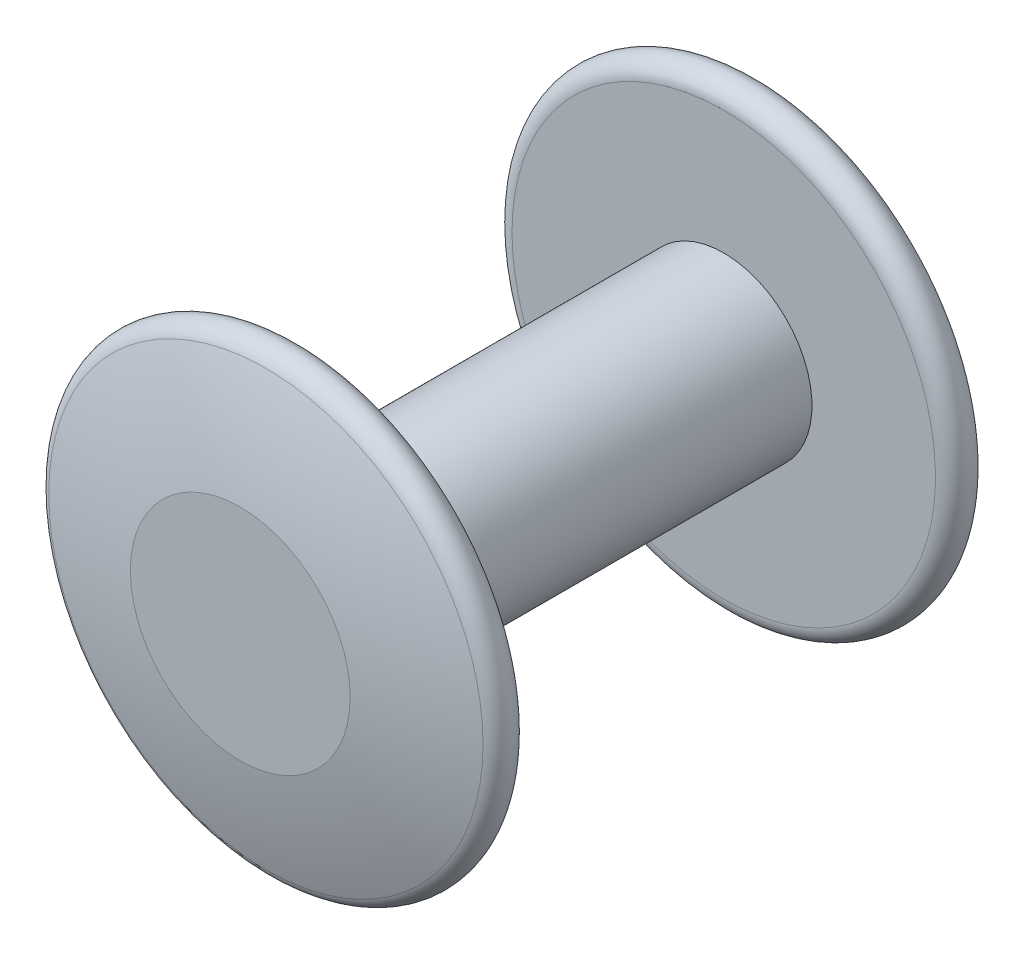
ISO-10303-21;
HEADER;
FILE_DESCRIPTION(('STEP AP214'),'2;1');
FILE_NAME('part.step','',(''),(''),'','','');
FILE_SCHEMA(('AUTOMOTIVE_DESIGN { 1 0 10303 214 1 1 1 1 }'));
ENDSEC;
DATA;
#1=APPLICATION_CONTEXT('core data for automotive mechanical design processes');
#2=APPLICATION_PROTOCOL_DEFINITION('international standard','automotive_design',2000,#1);
#3=PRODUCT_CONTEXT('',#1,'mechanical');
#4=PRODUCT('Part','Part','',(#3));
#5=PRODUCT_RELATED_PRODUCT_CATEGORY('part','',(#4));
#6=PRODUCT_DEFINITION_FORMATION('','',#4);
#7=PRODUCT_DEFINITION_CONTEXT('part definition',#1,'design');
#8=PRODUCT_DEFINITION('design','',#6,#7);
#9=PRODUCT_DEFINITION_SHAPE('','',#8);
#10=(LENGTH_UNIT() NAMED_UNIT(*) SI_UNIT(.MILLI.,.METRE.));
#11=(NAMED_UNIT(*) PLANE_ANGLE_UNIT() SI_UNIT($,.RADIAN.));
#12=(NAMED_UNIT(*) SI_UNIT($,.STERADIAN.) SOLID_ANGLE_UNIT());
#13=UNCERTAINTY_MEASURE_WITH_UNIT(LENGTH_MEASURE(1.E-05),#10,'distance_accuracy_value','');
#14=(GEOMETRIC_REPRESENTATION_CONTEXT(3) GLOBAL_UNCERTAINTY_ASSIGNED_CONTEXT((#13)) GLOBAL_UNIT_ASSIGNED_CONTEXT((#10,
#11,#12)) REPRESENTATION_CONTEXT('',''));
#15=CARTESIAN_POINT('',(0.,0.,0.));
#16=DIRECTION('',(0.,0.,1.));
#17=DIRECTION('',(1.,0.,0.));
#18=AXIS2_PLACEMENT_3D('',#15,#16,#17);
#19=CARTESIAN_POINT('',(0.,0.,6.5));
#20=DIRECTION('',(0.,0.,-1.));
#21=DIRECTION('',(-1.,0.,0.));
#22=AXIS2_PLACEMENT_3D('',#19,#20,#21);
#23=TOROIDAL_SURFACE('',#22,6.,0.5);
#24=CARTESIAN_POINT('',(0.,0.,6.));
#25=DIRECTION('',(0.,0.,-1.));
#26=DIRECTION('',(-1.,0.,0.));
#27=AXIS2_PLACEMENT_3D('',#24,#25,#26);
#28=CIRCLE('',#27,6.);
#29=CARTESIAN_POINT('',(-6.,0.,6.));
#30=VERTEX_POINT('',#29);
#31=EDGE_CURVE('E42',#30,#30,#28,.T.);
#32=ORIENTED_EDGE('',*,*,#31,.F.);
#33=EDGE_LOOP('',(#32));
#34=FACE_BOUND('',#33,.T.);
#35=CARTESIAN_POINT('',(0.,0.,6.97574295680204));
#36=DIRECTION('',(0.,0.,-1.));
#37=DIRECTION('',(-1.,0.,0.));
#38=AXIS2_PLACEMENT_3D('',#35,#36,#37);
#39=CIRCLE('',#38,6.15384615384616);
#40=CARTESIAN_POINT('',(-6.15384615384616,0.,6.97574295680204));
#41=VERTEX_POINT('',#40);
#42=EDGE_CURVE('E10',#41,#41,#39,.T.);
#43=ORIENTED_EDGE('',*,*,#42,.T.);
#44=EDGE_LOOP('',(#43));
#45=FACE_BOUND('',#44,.T.);
#46=ADVANCED_FACE('F14',(#34,#45),#23,.T.);
#47=CARTESIAN_POINT('',(0.,0.,-12.0539753152795));
#48=DIRECTION('',(0.,0.,-1.));
#49=DIRECTION('',(0.,1.,0.));
#50=AXIS2_PLACEMENT_3D('',#47,#48,#49);
#51=SPHERICAL_SURFACE('',#50,20.);
#52=ORIENTED_EDGE('',*,*,#42,.F.);
#53=EDGE_LOOP('',(#52));
#54=FACE_BOUND('',#53,.T.);
#55=CARTESIAN_POINT('',(0.,0.,7.70196512603628));
#56=DIRECTION('',(0.,0.,-1.));
#57=DIRECTION('',(-1.,0.,0.));
#58=AXIS2_PLACEMENT_3D('',#55,#56,#57);
#59=CIRCLE('',#58,3.11493455455888);
#60=CARTESIAN_POINT('',(-3.11493455455888,0.,7.70196512603628));
#61=VERTEX_POINT('',#60);
#62=EDGE_CURVE('E20',#61,#61,#59,.T.);
#63=ORIENTED_EDGE('',*,*,#62,.T.);
#64=EDGE_LOOP('',(#63));
#65=FACE_BOUND('',#64,.T.);
#66=ADVANCED_FACE('F49',(#54,#65),#51,.T.);
#67=CARTESIAN_POINT('',(0.,0.,7.70196512603628));
#68=DIRECTION('',(0.,0.,1.));
#69=DIRECTION('',(1.,0.,0.));
#70=AXIS2_PLACEMENT_3D('',#67,#68,#69);
#71=PLANE('',#70);
#72=ORIENTED_EDGE('',*,*,#62,.F.);
#73=EDGE_LOOP('',(#72));
#74=FACE_BOUND('',#73,.T.);
#75=ADVANCED_FACE('F55',(#74),#71,.T.);
#76=CARTESIAN_POINT('',(0.,0.,-7.70196512603628));
#77=DIRECTION('',(0.,0.,-1.));
#78=DIRECTION('',(-1.,0.,0.));
#79=AXIS2_PLACEMENT_3D('',#76,#77,#78);
#80=PLANE('',#79);
#81=CARTESIAN_POINT('',(0.,0.,-7.70196512603628));
#82=DIRECTION('',(0.,0.,-1.));
#83=DIRECTION('',(-1.,0.,0.));
#84=AXIS2_PLACEMENT_3D('',#81,#82,#83);
#85=CIRCLE('',#84,3.11493455455888);
#86=CARTESIAN_POINT('',(-3.11493455455888,0.,-7.70196512603628));
#87=VERTEX_POINT('',#86);
#88=EDGE_CURVE('E24',#87,#87,#85,.T.);
#89=ORIENTED_EDGE('',*,*,#88,.T.);
#90=EDGE_LOOP('',(#89));
#91=FACE_BOUND('',#90,.T.);
#92=ADVANCED_FACE('F61',(#91),#80,.T.);
#93=CARTESIAN_POINT('',(0.,0.,12.0539753152795));
#94=DIRECTION('',(0.,0.,-1.));
#95=DIRECTION('',(0.,1.,0.));
#96=AXIS2_PLACEMENT_3D('',#93,#94,#95);
#97=SPHERICAL_SURFACE('',#96,20.);
#98=CARTESIAN_POINT('',(0.,0.,-6.97574295680204));
#99=DIRECTION('',(0.,0.,-1.));
#100=DIRECTION('',(-1.,0.,0.));
#101=AXIS2_PLACEMENT_3D('',#98,#99,#100);
#102=CIRCLE('',#101,6.15384615384616);
#103=CARTESIAN_POINT('',(-6.15384615384616,0.,-6.97574295680204));
#104=VERTEX_POINT('',#103);
#105=EDGE_CURVE('E28',#104,#104,#102,.T.);
#106=ORIENTED_EDGE('',*,*,#105,.T.);
#107=EDGE_LOOP('',(#106));
#108=FACE_BOUND('',#107,.T.);
#109=ORIENTED_EDGE('',*,*,#88,.F.);
#110=EDGE_LOOP('',(#109));
#111=FACE_BOUND('',#110,.T.);
#112=ADVANCED_FACE('F67',(#108,#111),#97,.T.);
#113=CARTESIAN_POINT('',(0.,0.,-6.5));
#114=DIRECTION('',(0.,0.,-1.));
#115=DIRECTION('',(-1.,0.,0.));
#116=AXIS2_PLACEMENT_3D('',#113,#114,#115);
#117=TOROIDAL_SURFACE('',#116,6.,0.5);
#118=CARTESIAN_POINT('',(0.,0.,-6.));
#119=DIRECTION('',(0.,0.,-1.));
#120=DIRECTION('',(-1.,0.,0.));
#121=AXIS2_PLACEMENT_3D('',#118,#119,#120);
#122=CIRCLE('',#121,6.);
#123=CARTESIAN_POINT('',(-6.,0.,-6.));
#124=VERTEX_POINT('',#123);
#125=EDGE_CURVE('E33',#124,#124,#122,.T.);
#126=ORIENTED_EDGE('',*,*,#125,.T.);
#127=EDGE_LOOP('',(#126));
#128=FACE_BOUND('',#127,.T.);
#129=ORIENTED_EDGE('',*,*,#105,.F.);
#130=EDGE_LOOP('',(#129));
#131=FACE_BOUND('',#130,.T.);
#132=ADVANCED_FACE('F71',(#128,#131),#117,.T.);
#133=CARTESIAN_POINT('',(0.,0.,-6.));
#134=DIRECTION('',(0.,0.,1.));
#135=DIRECTION('',(1.,0.,0.));
#136=AXIS2_PLACEMENT_3D('',#133,#134,#135);
#137=PLANE('',#136);
#138=CARTESIAN_POINT('',(0.,0.,-6.));
#139=DIRECTION('',(0.,0.,-1.));
#140=DIRECTION('',(-1.,0.,0.));
#141=AXIS2_PLACEMENT_3D('',#138,#139,#140);
#142=CIRCLE('',#141,2.5);
#143=CARTESIAN_POINT('',(-2.5,0.,-6.));
#144=VERTEX_POINT('',#143);
#145=EDGE_CURVE('E36',#144,#144,#142,.T.);
#146=ORIENTED_EDGE('',*,*,#145,.T.);
#147=EDGE_LOOP('',(#146));
#148=FACE_BOUND('',#147,.T.);
#149=ORIENTED_EDGE('',*,*,#125,.F.);
#150=EDGE_LOOP('',(#149));
#151=FACE_BOUND('',#150,.T.);
#152=ADVANCED_FACE('F75',(#148,#151),#137,.T.);
#153=CARTESIAN_POINT('',(0.,0.,-7.94602468472053));
#154=DIRECTION('',(0.,0.,-1.));
#155=DIRECTION('',(-1.,0.,0.));
#156=AXIS2_PLACEMENT_3D('',#153,#154,#155);
#157=CYLINDRICAL_SURFACE('',#156,2.5);
#158=ORIENTED_EDGE('',*,*,#145,.F.);
#159=EDGE_LOOP('',(#158));
#160=FACE_BOUND('',#159,.T.);
#161=CARTESIAN_POINT('',(0.,0.,6.));
#162=DIRECTION('',(0.,0.,-1.));
#163=DIRECTION('',(-1.,0.,0.));
#164=AXIS2_PLACEMENT_3D('',#161,#162,#163);
#165=CIRCLE('',#164,2.5);
#166=CARTESIAN_POINT('',(-2.5,0.,6.));
#167=VERTEX_POINT('',#166);
#168=EDGE_CURVE('E39',#167,#167,#165,.T.);
#169=ORIENTED_EDGE('',*,*,#168,.T.);
#170=EDGE_LOOP('',(#169));
#171=FACE_BOUND('',#170,.T.);
#172=ADVANCED_FACE('F79',(#160,#171),#157,.T.);
#173=CARTESIAN_POINT('',(0.,0.,6.));
#174=DIRECTION('',(0.,0.,1.));
#175=DIRECTION('',(1.,0.,0.));
#176=AXIS2_PLACEMENT_3D('',#173,#174,#175);
#177=PLANE('',#176);
#178=ORIENTED_EDGE('',*,*,#168,.F.);
#179=EDGE_LOOP('',(#178));
#180=FACE_BOUND('',#179,.T.);
#181=ORIENTED_EDGE('',*,*,#31,.T.);
#182=EDGE_LOOP('',(#181));
#183=FACE_BOUND('',#182,.T.);
#184=ADVANCED_FACE('F46',(#180,#183),#177,.F.);
#185=CLOSED_SHELL('',(#46,#66,#75,#92,#112,#132,#152,#172,#184));
#186=MANIFOLD_SOLID_BREP('B1',#185);
#187=ADVANCED_BREP_SHAPE_REPRESENTATION('',(#18,#186),#14);
#188=SHAPE_DEFINITION_REPRESENTATION(#9,#187);
ENDSEC;
END-ISO-10303-21;
